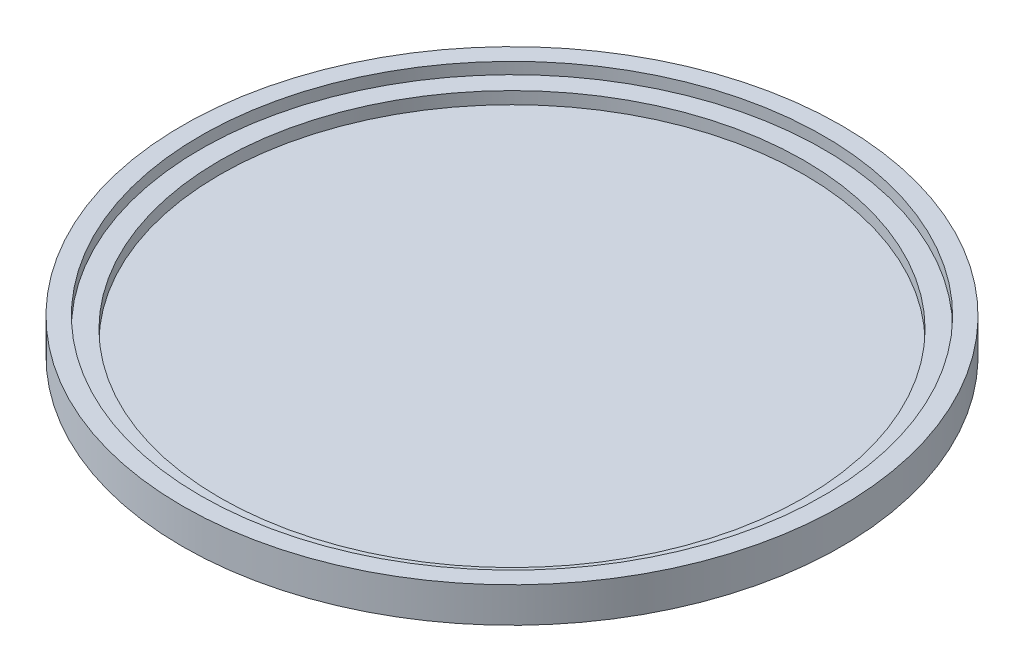
ISO-10303-21;
HEADER;
FILE_DESCRIPTION(('STEP AP214'),'2;1');
FILE_NAME('part.step','',(''),(''),'','','');
FILE_SCHEMA(('AUTOMOTIVE_DESIGN { 1 0 10303 214 1 1 1 1 }'));
ENDSEC;
DATA;
#1=APPLICATION_CONTEXT('core data for automotive mechanical design processes');
#2=APPLICATION_PROTOCOL_DEFINITION('international standard','automotive_design',2000,#1);
#3=PRODUCT_CONTEXT('',#1,'mechanical');
#4=PRODUCT('Part','Part','',(#3));
#5=PRODUCT_RELATED_PRODUCT_CATEGORY('part','',(#4));
#6=PRODUCT_DEFINITION_FORMATION('','',#4);
#7=PRODUCT_DEFINITION_CONTEXT('part definition',#1,'design');
#8=PRODUCT_DEFINITION('design','',#6,#7);
#9=PRODUCT_DEFINITION_SHAPE('','',#8);
#10=(LENGTH_UNIT() NAMED_UNIT(*) SI_UNIT(.MILLI.,.METRE.));
#11=(NAMED_UNIT(*) PLANE_ANGLE_UNIT() SI_UNIT($,.RADIAN.));
#12=(NAMED_UNIT(*) SI_UNIT($,.STERADIAN.) SOLID_ANGLE_UNIT());
#13=UNCERTAINTY_MEASURE_WITH_UNIT(LENGTH_MEASURE(1.E-05),#10,'distance_accuracy_value','');
#14=(GEOMETRIC_REPRESENTATION_CONTEXT(3) GLOBAL_UNCERTAINTY_ASSIGNED_CONTEXT((#13)) GLOBAL_UNIT_ASSIGNED_CONTEXT((#10,
#11,#12)) REPRESENTATION_CONTEXT('',''));
#15=CARTESIAN_POINT('',(0.,0.,0.));
#16=DIRECTION('',(0.,0.,1.));
#17=DIRECTION('',(1.,0.,0.));
#18=AXIS2_PLACEMENT_3D('',#15,#16,#17);
#19=CARTESIAN_POINT('',(0.,16.4,0.));
#20=DIRECTION('',(0.,-1.,0.));
#21=DIRECTION('',(0.,0.,-1.));
#22=AXIS2_PLACEMENT_3D('',#19,#20,#21);
#23=CYLINDRICAL_SURFACE('',#22,154.);
#24=CARTESIAN_POINT('',(0.,16.4,0.));
#25=DIRECTION('',(0.,1.,0.));
#26=DIRECTION('',(0.,0.,1.));
#27=AXIS2_PLACEMENT_3D('',#24,#25,#26);
#28=CIRCLE('',#27,154.);
#29=CARTESIAN_POINT('',(0.,16.4,154.));
#30=VERTEX_POINT('',#29);
#31=EDGE_CURVE('E11',#30,#30,#28,.T.);
#32=ORIENTED_EDGE('',*,*,#31,.F.);
#33=EDGE_LOOP('',(#32));
#34=FACE_BOUND('',#33,.T.);
#35=CARTESIAN_POINT('',(0.,0.,0.));
#36=DIRECTION('',(0.,1.,0.));
#37=DIRECTION('',(0.,0.,1.));
#38=AXIS2_PLACEMENT_3D('',#35,#36,#37);
#39=CIRCLE('',#38,154.);
#40=CARTESIAN_POINT('',(0.,0.,154.));
#41=VERTEX_POINT('',#40);
#42=EDGE_CURVE('E42',#41,#41,#39,.T.);
#43=ORIENTED_EDGE('',*,*,#42,.T.);
#44=EDGE_LOOP('',(#43));
#45=FACE_BOUND('',#44,.T.);
#46=ADVANCED_FACE('F39',(#34,#45),#23,.T.);
#47=CARTESIAN_POINT('',(0.,16.4,0.));
#48=DIRECTION('',(0.,1.,0.));
#49=DIRECTION('',(0.,0.,1.));
#50=AXIS2_PLACEMENT_3D('',#47,#48,#49);
#51=PLANE('',#50);
#52=CARTESIAN_POINT('',(0.,16.4,0.));
#53=DIRECTION('',(0.,1.,0.));
#54=DIRECTION('',(0.,0.,1.));
#55=AXIS2_PLACEMENT_3D('',#52,#53,#54);
#56=CIRCLE('',#55,145.6);
#57=CARTESIAN_POINT('',(0.,16.4,145.6));
#58=VERTEX_POINT('',#57);
#59=EDGE_CURVE('E53',#58,#58,#56,.T.);
#60=ORIENTED_EDGE('',*,*,#59,.F.);
#61=EDGE_LOOP('',(#60));
#62=FACE_BOUND('',#61,.T.);
#63=ORIENTED_EDGE('',*,*,#31,.T.);
#64=EDGE_LOOP('',(#63));
#65=FACE_BOUND('',#64,.T.);
#66=ADVANCED_FACE('F84',(#62,#65),#51,.T.);
#67=CARTESIAN_POINT('',(0.,0.,0.));
#68=DIRECTION('',(0.,1.,0.));
#69=DIRECTION('',(0.,0.,1.));
#70=AXIS2_PLACEMENT_3D('',#67,#68,#69);
#71=PLANE('',#70);
#72=CARTESIAN_POINT('',(0.,0.,0.));
#73=DIRECTION('',(0.,-1.,0.));
#74=DIRECTION('',(0.,0.,-1.));
#75=AXIS2_PLACEMENT_3D('',#72,#73,#74);
#76=CIRCLE('',#75,152.8);
#77=CARTESIAN_POINT('',(0.,0.,-152.8));
#78=VERTEX_POINT('',#77);
#79=EDGE_CURVE('E72',#78,#78,#76,.T.);
#80=ORIENTED_EDGE('',*,*,#79,.F.);
#81=EDGE_LOOP('',(#80));
#82=FACE_BOUND('',#81,.T.);
#83=ORIENTED_EDGE('',*,*,#42,.F.);
#84=EDGE_LOOP('',(#83));
#85=FACE_BOUND('',#84,.T.);
#86=ADVANCED_FACE('F80',(#82,#85),#71,.F.);
#87=CARTESIAN_POINT('',(0.,11.,0.));
#88=DIRECTION('',(0.,1.,0.));
#89=DIRECTION('',(0.,0.,1.));
#90=AXIS2_PLACEMENT_3D('',#87,#88,#89);
#91=CYLINDRICAL_SURFACE('',#90,145.6);
#92=CARTESIAN_POINT('',(0.,11.,0.));
#93=DIRECTION('',(0.,1.,0.));
#94=DIRECTION('',(0.,0.,1.));
#95=AXIS2_PLACEMENT_3D('',#92,#93,#94);
#96=CIRCLE('',#95,145.6);
#97=CARTESIAN_POINT('',(0.,11.,145.6));
#98=VERTEX_POINT('',#97);
#99=EDGE_CURVE('E51',#98,#98,#96,.T.);
#100=ORIENTED_EDGE('',*,*,#99,.F.);
#101=EDGE_LOOP('',(#100));
#102=FACE_BOUND('',#101,.T.);
#103=ORIENTED_EDGE('',*,*,#59,.T.);
#104=EDGE_LOOP('',(#103));
#105=FACE_BOUND('',#104,.T.);
#106=ADVANCED_FACE('F83',(#102,#105),#91,.F.);
#107=CARTESIAN_POINT('',(0.,11.,0.));
#108=DIRECTION('',(0.,1.,0.));
#109=DIRECTION('',(0.,0.,1.));
#110=AXIS2_PLACEMENT_3D('',#107,#108,#109);
#111=PLANE('',#110);
#112=CARTESIAN_POINT('',(0.,11.,0.));
#113=DIRECTION('',(0.,1.,0.));
#114=DIRECTION('',(0.,0.,1.));
#115=AXIS2_PLACEMENT_3D('',#112,#113,#114);
#116=CIRCLE('',#115,136.5);
#117=CARTESIAN_POINT('',(0.,11.,136.5));
#118=VERTEX_POINT('',#117);
#119=EDGE_CURVE('E61',#118,#118,#116,.T.);
#120=ORIENTED_EDGE('',*,*,#119,.F.);
#121=EDGE_LOOP('',(#120));
#122=FACE_BOUND('',#121,.T.);
#123=ORIENTED_EDGE('',*,*,#99,.T.);
#124=EDGE_LOOP('',(#123));
#125=FACE_BOUND('',#124,.T.);
#126=ADVANCED_FACE('F100',(#122,#125),#111,.T.);
#127=CARTESIAN_POINT('',(0.,5.28,0.));
#128=DIRECTION('',(0.,1.,0.));
#129=DIRECTION('',(0.,0.,1.));
#130=AXIS2_PLACEMENT_3D('',#127,#128,#129);
#131=CYLINDRICAL_SURFACE('',#130,136.5);
#132=CARTESIAN_POINT('',(0.,5.28,0.));
#133=DIRECTION('',(0.,1.,0.));
#134=DIRECTION('',(0.,0.,1.));
#135=AXIS2_PLACEMENT_3D('',#132,#133,#134);
#136=CIRCLE('',#135,136.5);
#137=CARTESIAN_POINT('',(0.,5.28,136.5));
#138=VERTEX_POINT('',#137);
#139=EDGE_CURVE('E57',#138,#138,#136,.T.);
#140=ORIENTED_EDGE('',*,*,#139,.F.);
#141=EDGE_LOOP('',(#140));
#142=FACE_BOUND('',#141,.T.);
#143=ORIENTED_EDGE('',*,*,#119,.T.);
#144=EDGE_LOOP('',(#143));
#145=FACE_BOUND('',#144,.T.);
#146=ADVANCED_FACE('F104',(#142,#145),#131,.F.);
#147=CARTESIAN_POINT('',(0.,5.28,0.));
#148=DIRECTION('',(0.,1.,0.));
#149=DIRECTION('',(0.,0.,1.));
#150=AXIS2_PLACEMENT_3D('',#147,#148,#149);
#151=PLANE('',#150);
#152=ORIENTED_EDGE('',*,*,#139,.T.);
#153=EDGE_LOOP('',(#152));
#154=FACE_BOUND('',#153,.T.);
#155=ADVANCED_FACE('F108',(#154),#151,.T.);
#156=CARTESIAN_POINT('',(0.,4.08,0.));
#157=DIRECTION('',(0.,1.,0.));
#158=DIRECTION('',(0.,0.,1.));
#159=AXIS2_PLACEMENT_3D('',#156,#157,#158);
#160=PLANE('',#159);
#161=CARTESIAN_POINT('',(0.,4.07999999999997,0.));
#162=DIRECTION('',(0.,1.,0.));
#163=DIRECTION('',(0.,0.,1.));
#164=AXIS2_PLACEMENT_3D('',#161,#162,#163);
#165=CIRCLE('',#164,152.8);
#166=CARTESIAN_POINT('',(0.,4.07999999999997,152.8));
#167=VERTEX_POINT('',#166);
#168=EDGE_CURVE('E65',#167,#167,#165,.F.);
#169=ORIENTED_EDGE('',*,*,#168,.T.);
#170=EDGE_LOOP('',(#169));
#171=FACE_BOUND('',#170,.T.);
#172=ADVANCED_FACE('F112',(#171),#160,.F.);
#173=CARTESIAN_POINT('',(0.,437.463664661218,0.));
#174=DIRECTION('',(0.,-1.,0.));
#175=DIRECTION('',(0.,0.,-1.));
#176=AXIS2_PLACEMENT_3D('',#173,#174,#175);
#177=CYLINDRICAL_SURFACE('',#176,152.8);
#178=ORIENTED_EDGE('',*,*,#79,.T.);
#179=EDGE_LOOP('',(#178));
#180=FACE_BOUND('',#179,.T.);
#181=ORIENTED_EDGE('',*,*,#168,.F.);
#182=EDGE_LOOP('',(#181));
#183=FACE_BOUND('',#182,.T.);
#184=ADVANCED_FACE('F77',(#180,#183),#177,.F.);
#185=CLOSED_SHELL('',(#46,#66,#86,#106,#126,#146,#155,#172,#184));
#186=MANIFOLD_SOLID_BREP('B2',#185);
#187=ADVANCED_BREP_SHAPE_REPRESENTATION('',(#18,#186),#14);
#188=SHAPE_DEFINITION_REPRESENTATION(#9,#187);
ENDSEC;
END-ISO-10303-21;
